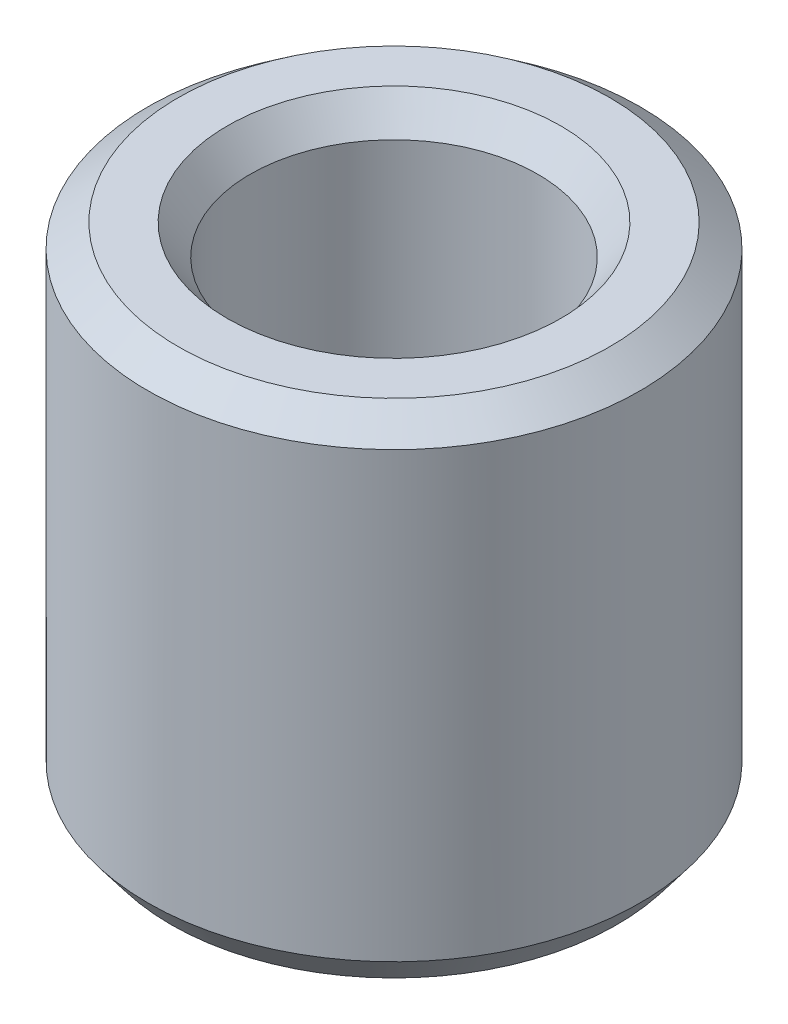
ISO-10303-21;
HEADER;
FILE_DESCRIPTION(('STEP AP214'),'2;1');
FILE_NAME('part.step','',(''),(''),'','','');
FILE_SCHEMA(('AUTOMOTIVE_DESIGN { 1 0 10303 214 1 1 1 1 }'));
ENDSEC;
DATA;
#1=APPLICATION_CONTEXT('core data for automotive mechanical design processes');
#2=APPLICATION_PROTOCOL_DEFINITION('international standard','automotive_design',2000,#1);
#3=PRODUCT_CONTEXT('',#1,'mechanical');
#4=PRODUCT('Part','Part','',(#3));
#5=PRODUCT_RELATED_PRODUCT_CATEGORY('part','',(#4));
#6=PRODUCT_DEFINITION_FORMATION('','',#4);
#7=PRODUCT_DEFINITION_CONTEXT('part definition',#1,'design');
#8=PRODUCT_DEFINITION('design','',#6,#7);
#9=PRODUCT_DEFINITION_SHAPE('','',#8);
#10=(LENGTH_UNIT() NAMED_UNIT(*) SI_UNIT(.MILLI.,.METRE.));
#11=(NAMED_UNIT(*) PLANE_ANGLE_UNIT() SI_UNIT($,.RADIAN.));
#12=(NAMED_UNIT(*) SI_UNIT($,.STERADIAN.) SOLID_ANGLE_UNIT());
#13=UNCERTAINTY_MEASURE_WITH_UNIT(LENGTH_MEASURE(1.E-05),#10,'distance_accuracy_value','');
#14=(GEOMETRIC_REPRESENTATION_CONTEXT(3) GLOBAL_UNCERTAINTY_ASSIGNED_CONTEXT((#13)) GLOBAL_UNIT_ASSIGNED_CONTEXT((#10,
#11,#12)) REPRESENTATION_CONTEXT('',''));
#15=CARTESIAN_POINT('',(0.,0.,0.));
#16=DIRECTION('',(0.,0.,1.));
#17=DIRECTION('',(1.,0.,0.));
#18=AXIS2_PLACEMENT_3D('',#15,#16,#17);
#19=CARTESIAN_POINT('',(0.,40.3829010051115,0.));
#20=DIRECTION('',(0.,-1.,0.));
#21=DIRECTION('',(0.,0.,-1.));
#22=AXIS2_PLACEMENT_3D('',#19,#20,#21);
#23=CYLINDRICAL_SURFACE('',#22,20.);
#24=CARTESIAN_POINT('',(0.,2.46317415925098,0.));
#25=DIRECTION('',(0.,1.,0.));
#26=DIRECTION('',(0.,0.,1.));
#27=AXIS2_PLACEMENT_3D('',#24,#25,#26);
#28=CIRCLE('',#27,20.);
#29=CARTESIAN_POINT('',(0.,2.46317415925098,20.));
#30=VERTEX_POINT('',#29);
#31=EDGE_CURVE('E10',#30,#30,#28,.T.);
#32=ORIENTED_EDGE('',*,*,#31,.T.);
#33=EDGE_LOOP('',(#32));
#34=FACE_BOUND('',#33,.T.);
#35=CARTESIAN_POINT('',(0.,38.5114216156845,0.));
#36=DIRECTION('',(0.,1.,0.));
#37=DIRECTION('',(0.,0.,1.));
#38=AXIS2_PLACEMENT_3D('',#35,#36,#37);
#39=CIRCLE('',#38,20.);
#40=CARTESIAN_POINT('',(0.,38.5114216156845,-20.));
#41=VERTEX_POINT('',#40);
#42=EDGE_CURVE('E50',#41,#41,#39,.F.);
#43=ORIENTED_EDGE('',*,*,#42,.T.);
#44=EDGE_LOOP('',(#43));
#45=FACE_BOUND('',#44,.T.);
#46=ADVANCED_FACE('F39',(#34,#45),#23,.T.);
#47=CARTESIAN_POINT('',(0.,40.3829010051115,0.));
#48=DIRECTION('',(0.,1.,0.));
#49=DIRECTION('',(0.,0.,1.));
#50=AXIS2_PLACEMENT_3D('',#47,#48,#49);
#51=PLANE('',#50);
#52=CARTESIAN_POINT('',(0.,40.3829010051115,0.));
#53=DIRECTION('',(0.,1.,0.));
#54=DIRECTION('',(0.,0.,1.));
#55=AXIS2_PLACEMENT_3D('',#52,#53,#54);
#56=CIRCLE('',#55,13.5580959767007);
#57=CARTESIAN_POINT('',(0.,40.3829010051115,13.5580959767007));
#58=VERTEX_POINT('',#57);
#59=EDGE_CURVE('E58',#58,#58,#56,.F.);
#60=ORIENTED_EDGE('',*,*,#59,.T.);
#61=EDGE_LOOP('',(#60));
#62=FACE_BOUND('',#61,.T.);
#63=CARTESIAN_POINT('',(0.,40.3829010051115,0.));
#64=DIRECTION('',(0.,1.,0.));
#65=DIRECTION('',(0.,0.,1.));
#66=AXIS2_PLACEMENT_3D('',#63,#64,#65);
#67=CIRCLE('',#66,17.536825840749);
#68=CARTESIAN_POINT('',(0.,40.3829010051115,-17.536825840749));
#69=VERTEX_POINT('',#68);
#70=EDGE_CURVE('E61',#69,#69,#67,.T.);
#71=ORIENTED_EDGE('',*,*,#70,.T.);
#72=EDGE_LOOP('',(#71));
#73=FACE_BOUND('',#72,.T.);
#74=ADVANCED_FACE('F88',(#62,#73),#51,.T.);
#75=CARTESIAN_POINT('',(0.,0.,0.));
#76=DIRECTION('',(0.,1.,0.));
#77=DIRECTION('',(0.,0.,1.));
#78=AXIS2_PLACEMENT_3D('',#75,#76,#77);
#79=PLANE('',#78);
#80=CARTESIAN_POINT('',(0.,0.,0.));
#81=DIRECTION('',(0.,1.,0.));
#82=DIRECTION('',(0.,0.,1.));
#83=AXIS2_PLACEMENT_3D('',#80,#81,#82);
#84=CIRCLE('',#83,14.1497907465247);
#85=CARTESIAN_POINT('',(0.,0.,14.1497907465247));
#86=VERTEX_POINT('',#85);
#87=EDGE_CURVE('E51',#86,#86,#84,.T.);
#88=ORIENTED_EDGE('',*,*,#87,.T.);
#89=EDGE_LOOP('',(#88));
#90=FACE_BOUND('',#89,.T.);
#91=CARTESIAN_POINT('',(0.,0.,0.));
#92=DIRECTION('',(0.,1.,0.));
#93=DIRECTION('',(0.,0.,1.));
#94=AXIS2_PLACEMENT_3D('',#91,#92,#93);
#95=CIRCLE('',#94,18.128520610573);
#96=CARTESIAN_POINT('',(0.,0.,18.128520610573));
#97=VERTEX_POINT('',#96);
#98=EDGE_CURVE('E54',#97,#97,#95,.F.);
#99=ORIENTED_EDGE('',*,*,#98,.T.);
#100=EDGE_LOOP('',(#99));
#101=FACE_BOUND('',#100,.T.);
#102=ADVANCED_FACE('F83',(#90,#101),#79,.F.);
#103=CARTESIAN_POINT('',(0.,40.3829010051115,0.));
#104=DIRECTION('',(0.,-1.,0.));
#105=DIRECTION('',(0.,0.,-1.));
#106=AXIS2_PLACEMENT_3D('',#103,#104,#105);
#107=CYLINDRICAL_SURFACE('',#106,11.6866165872737);
#108=CARTESIAN_POINT('',(0.,37.9197268458605,0.));
#109=DIRECTION('',(0.,1.,0.));
#110=DIRECTION('',(0.,0.,1.));
#111=AXIS2_PLACEMENT_3D('',#108,#109,#110);
#112=CIRCLE('',#111,11.6866165872737);
#113=CARTESIAN_POINT('',(0.,37.9197268458605,11.6866165872737));
#114=VERTEX_POINT('',#113);
#115=EDGE_CURVE('E67',#114,#114,#112,.T.);
#116=ORIENTED_EDGE('',*,*,#115,.T.);
#117=EDGE_LOOP('',(#116));
#118=FACE_BOUND('',#117,.T.);
#119=CARTESIAN_POINT('',(0.,1.87147938942696,0.));
#120=DIRECTION('',(0.,1.,0.));
#121=DIRECTION('',(0.,0.,1.));
#122=AXIS2_PLACEMENT_3D('',#119,#120,#121);
#123=CIRCLE('',#122,11.6866165872737);
#124=CARTESIAN_POINT('',(0.,1.87147938942696,11.6866165872737));
#125=VERTEX_POINT('',#124);
#126=EDGE_CURVE('E69',#125,#125,#123,.F.);
#127=ORIENTED_EDGE('',*,*,#126,.T.);
#128=EDGE_LOOP('',(#127));
#129=FACE_BOUND('',#128,.T.);
#130=ADVANCED_FACE('F71',(#118,#129),#107,.F.);
#131=CARTESIAN_POINT('',(0.,37.9197268458605,0.));
#132=DIRECTION('',(0.,1.,0.));
#133=DIRECTION('',(0.,0.,1.));
#134=AXIS2_PLACEMENT_3D('',#131,#132,#133);
#135=CONICAL_SURFACE('',#134,11.6866165872737,0.649733279985397);
#136=ORIENTED_EDGE('',*,*,#59,.F.);
#137=EDGE_LOOP('',(#136));
#138=FACE_BOUND('',#137,.T.);
#139=ORIENTED_EDGE('',*,*,#115,.F.);
#140=EDGE_LOOP('',(#139));
#141=FACE_BOUND('',#140,.T.);
#142=ADVANCED_FACE('F77',(#138,#141),#135,.F.);
#143=CARTESIAN_POINT('',(0.,0.,0.));
#144=DIRECTION('',(0.,-1.,0.));
#145=DIRECTION('',(0.,0.,-1.));
#146=AXIS2_PLACEMENT_3D('',#143,#144,#145);
#147=CONICAL_SURFACE('',#146,14.1497907465247,0.921063046809499);
#148=ORIENTED_EDGE('',*,*,#126,.F.);
#149=EDGE_LOOP('',(#148));
#150=FACE_BOUND('',#149,.T.);
#151=ORIENTED_EDGE('',*,*,#87,.F.);
#152=EDGE_LOOP('',(#151));
#153=FACE_BOUND('',#152,.T.);
#154=ADVANCED_FACE('F73',(#150,#153),#147,.F.);
#155=CARTESIAN_POINT('',(0.,2.46317415925098,0.));
#156=DIRECTION('',(0.,1.,0.));
#157=DIRECTION('',(0.,0.,1.));
#158=AXIS2_PLACEMENT_3D('',#155,#156,#157);
#159=CONICAL_SURFACE('',#158,20.,0.649733279985399);
#160=ORIENTED_EDGE('',*,*,#98,.F.);
#161=EDGE_LOOP('',(#160));
#162=FACE_BOUND('',#161,.T.);
#163=ORIENTED_EDGE('',*,*,#31,.F.);
#164=EDGE_LOOP('',(#163));
#165=FACE_BOUND('',#164,.T.);
#166=ADVANCED_FACE('F76',(#162,#165),#159,.T.);
#167=CARTESIAN_POINT('',(0.,40.3829010051115,0.));
#168=DIRECTION('',(0.,-1.,0.));
#169=DIRECTION('',(0.,0.,-1.));
#170=AXIS2_PLACEMENT_3D('',#167,#168,#169);
#171=CONICAL_SURFACE('',#170,17.536825840749,0.921063046809498);
#172=CARTESIAN_POINT('',(0.,38.5114216156845,-20.));
#173=CARTESIAN_POINT('',(0.,38.5309161926577,-19.9743419358411));
#174=CARTESIAN_POINT('',(0.,38.5504107696309,-19.9486838716823));
#175=CARTESIAN_POINT('',(0.,38.5893999235773,-19.8973677433646));
#176=CARTESIAN_POINT('',(0.,38.6088945005505,-19.8717096792057));
#177=CARTESIAN_POINT('',(0.,38.6478836544969,-19.820393550888));
#178=CARTESIAN_POINT('',(0.,38.6673782314701,-19.7947354867291));
#179=CARTESIAN_POINT('',(0.,38.7063673854165,-19.7434193584114));
#180=CARTESIAN_POINT('',(0.,38.7258619623897,-19.7177612942525));
#181=CARTESIAN_POINT('',(0.,38.7648511163361,-19.6664451659348));
#182=CARTESIAN_POINT('',(0.,38.7843456933093,-19.6407871017759));
#183=CARTESIAN_POINT('',(0.,38.8233348472557,-19.5894709734582));
#184=CARTESIAN_POINT('',(0.,38.8428294242289,-19.5638129092993));
#185=CARTESIAN_POINT('',(0.,38.8818185781753,-19.5124967809816));
#186=CARTESIAN_POINT('',(0.,38.9013131551485,-19.4868387168227));
#187=CARTESIAN_POINT('',(0.,38.9403023090949,-19.435522588505));
#188=CARTESIAN_POINT('',(0.,38.9597968860681,-19.4098645243461));
#189=CARTESIAN_POINT('',(0.,38.9987860400145,-19.3585483960284));
#190=CARTESIAN_POINT('',(0.,39.0182806169877,-19.3328903318695));
#191=CARTESIAN_POINT('',(0.,39.057269770934,-19.2815742035518));
#192=CARTESIAN_POINT('',(0.,39.0767643479072,-19.2559161393929));
#193=CARTESIAN_POINT('',(0.,39.1157535018536,-19.2046000110752));
#194=CARTESIAN_POINT('',(0.,39.1352480788268,-19.1789419469163));
#195=CARTESIAN_POINT('',(0.,39.1742372327732,-19.1276258185986));
#196=CARTESIAN_POINT('',(0.,39.1937318097464,-19.1019677544398));
#197=CARTESIAN_POINT('',(0.,39.2327209636928,-19.050651626122));
#198=CARTESIAN_POINT('',(0.,39.252215540666,-19.0249935619632));
#199=CARTESIAN_POINT('',(0.,39.2912046946124,-18.9736774336454));
#200=CARTESIAN_POINT('',(0.,39.3106992715856,-18.9480193694866));
#201=CARTESIAN_POINT('',(0.,39.349688425532,-18.8967032411688));
#202=CARTESIAN_POINT('',(0.,39.3691830025052,-18.87104517701));
#203=CARTESIAN_POINT('',(0.,39.4081721564516,-18.8197290486922));
#204=CARTESIAN_POINT('',(0.,39.4276667334248,-18.7940709845334));
#205=CARTESIAN_POINT('',(0.,39.4666558873712,-18.7427548562157));
#206=CARTESIAN_POINT('',(0.,39.4861504643444,-18.7170967920568));
#207=CARTESIAN_POINT('',(0.,39.5251396182908,-18.6657806637391));
#208=CARTESIAN_POINT('',(0.,39.544634195264,-18.6401225995802));
#209=CARTESIAN_POINT('',(0.,39.5836233492104,-18.5888064712625));
#210=CARTESIAN_POINT('',(0.,39.6031179261836,-18.5631484071036));
#211=CARTESIAN_POINT('',(0.,39.64210708013,-18.5118322787859));
#212=CARTESIAN_POINT('',(0.,39.6616016571032,-18.486174214627));
#213=CARTESIAN_POINT('',(0.,39.7005908110496,-18.4348580863093));
#214=CARTESIAN_POINT('',(0.,39.7200853880228,-18.4092000221504));
#215=CARTESIAN_POINT('',(0.,39.7590745419692,-18.3578838938327));
#216=CARTESIAN_POINT('',(0.,39.7785691189424,-18.3322258296738));
#217=CARTESIAN_POINT('',(0.,39.8175582728887,-18.2809097013561));
#218=CARTESIAN_POINT('',(0.,39.8370528498619,-18.2552516371972));
#219=CARTESIAN_POINT('',(0.,39.8760420038083,-18.2039355088795));
#220=CARTESIAN_POINT('',(0.,39.8955365807815,-18.1782774447206));
#221=CARTESIAN_POINT('',(0.,39.9345257347279,-18.1269613164029));
#222=CARTESIAN_POINT('',(0.,39.9540203117011,-18.101303252244));
#223=CARTESIAN_POINT('',(0.,39.9930094656475,-18.0499871239263));
#224=CARTESIAN_POINT('',(0.,40.0125040426207,-18.0243290597674));
#225=CARTESIAN_POINT('',(0.,40.0514931965671,-17.9730129314497));
#226=CARTESIAN_POINT('',(0.,40.0709877735403,-17.9473548672909));
#227=CARTESIAN_POINT('',(0.,40.1099769274867,-17.8960387389731));
#228=CARTESIAN_POINT('',(0.,40.1294715044599,-17.8703806748143));
#229=CARTESIAN_POINT('',(0.,40.1684606584063,-17.8190645464965));
#230=CARTESIAN_POINT('',(0.,40.1879552353795,-17.7934064823377));
#231=CARTESIAN_POINT('',(0.,40.2269443893259,-17.7420903540199));
#232=CARTESIAN_POINT('',(0.,40.2464389662991,-17.7164322898611));
#233=CARTESIAN_POINT('',(0.,40.2854281202455,-17.6651161615434));
#234=CARTESIAN_POINT('',(0.,40.3049226972187,-17.6394580973845));
#235=CARTESIAN_POINT('',(0.,40.3439118511651,-17.5881419690668));
#236=CARTESIAN_POINT('',(0.,40.3634064281383,-17.5624839049079));
#237=CARTESIAN_POINT('',(0.,40.3829010051115,-17.536825840749));
#238=B_SPLINE_CURVE_WITH_KNOTS('',3,(#172,#173,#174,#175,#176,#177,#178,#179,#180,#181,#182,
#183,#184,#185,#186,#187,#188,#189,#190,#191,#192,#193,#194,#195,#196,#197,#198,#199,#200,#201,
#202,#203,#204,#205,#206,#207,#208,#209,#210,#211,#212,#213,#214,#215,#216,#217,#218,#219,#220,
#221,#222,#223,#224,#225,#226,#227,#228,#229,#230,#231,#232,#233,#234,#235,#236,#237),
.UNSPECIFIED.,.F.,.F.,(4,2,2,2,2,2,2,2,2,2,2,2,2,2,2,2,2,2,2,2,2,2,2,2,2,2,2,2,2,2,2,2,4),(0.,
0.0966714698848563,0.193342939769715,0.290014409654574,0.386685879539431,0.483357349424286,
0.580028819309145,0.676700289194001,0.77337175907886,0.870043228963719,0.966714698848571,
1.06338616873343,1.16005763861829,1.25672910850315,1.353400578388,1.45007204827286,
1.54674351815772,1.64341498804258,1.74008645792743,1.83675792781229,1.93342939769715,
2.030100867582,2.12677233746686,2.22344380735172,2.32011527723657,2.41678674712143,
2.51345821700629,2.61012968689115,2.706801156776,2.80347262666086,2.90014409654572,
2.99681556643058,3.09348703631543),.UNSPECIFIED.);
#239=EDGE_CURVE('BSEAM45',#41,#69,#238,.T.);
#240=ORIENTED_EDGE('',*,*,#42,.F.);
#241=ORIENTED_EDGE('',*,*,#70,.F.);
#242=ORIENTED_EDGE('',*,*,#239,.T.);
#243=ORIENTED_EDGE('',*,*,#239,.F.);
#244=EDGE_LOOP('',(#240,#242,#241,#243));
#245=FACE_BOUND('',#244,.T.);
#246=ADVANCED_FACE('F45',(#245),#171,.T.);
#247=CLOSED_SHELL('',(#46,#74,#102,#130,#142,#154,#166,#246));
#248=MANIFOLD_SOLID_BREP('B2',#247);
#249=ADVANCED_BREP_SHAPE_REPRESENTATION('',(#18,#248),#14);
#250=SHAPE_DEFINITION_REPRESENTATION(#9,#249);
ENDSEC;
END-ISO-10303-21;
